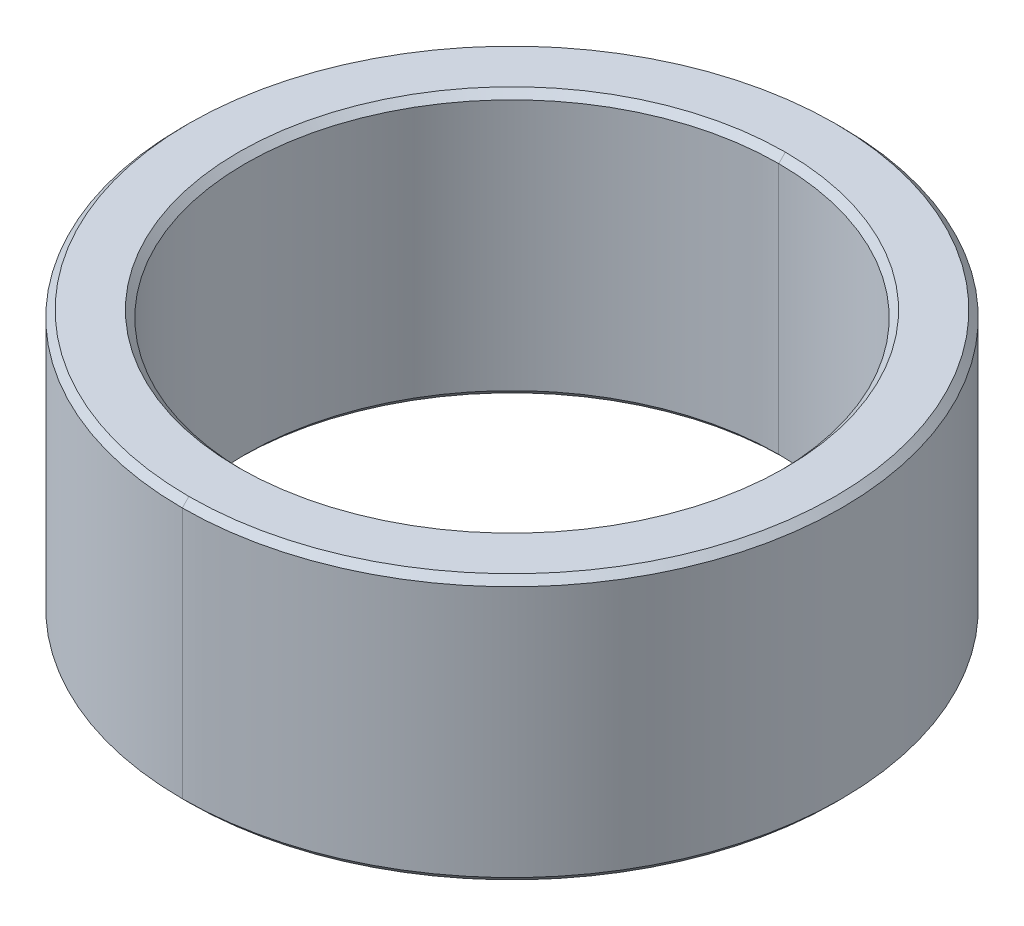
ISO-10303-21;
HEADER;
FILE_DESCRIPTION(('STEP AP214'),'2;1');
FILE_NAME('part.step','',(''),(''),'','','');
FILE_SCHEMA(('AUTOMOTIVE_DESIGN { 1 0 10303 214 1 1 1 1 }'));
ENDSEC;
DATA;
#1=APPLICATION_CONTEXT('core data for automotive mechanical design processes');
#2=APPLICATION_PROTOCOL_DEFINITION('international standard','automotive_design',2000,#1);
#3=PRODUCT_CONTEXT('',#1,'mechanical');
#4=PRODUCT('Part','Part','',(#3));
#5=PRODUCT_RELATED_PRODUCT_CATEGORY('part','',(#4));
#6=PRODUCT_DEFINITION_FORMATION('','',#4);
#7=PRODUCT_DEFINITION_CONTEXT('part definition',#1,'design');
#8=PRODUCT_DEFINITION('design','',#6,#7);
#9=PRODUCT_DEFINITION_SHAPE('','',#8);
#10=(LENGTH_UNIT() NAMED_UNIT(*) SI_UNIT(.MILLI.,.METRE.));
#11=(NAMED_UNIT(*) PLANE_ANGLE_UNIT() SI_UNIT($,.RADIAN.));
#12=(NAMED_UNIT(*) SI_UNIT($,.STERADIAN.) SOLID_ANGLE_UNIT());
#13=UNCERTAINTY_MEASURE_WITH_UNIT(LENGTH_MEASURE(1.E-05),#10,'distance_accuracy_value','');
#14=(GEOMETRIC_REPRESENTATION_CONTEXT(3) GLOBAL_UNCERTAINTY_ASSIGNED_CONTEXT((#13)) GLOBAL_UNIT_ASSIGNED_CONTEXT((#10,
#11,#12)) REPRESENTATION_CONTEXT('',''));
#15=CARTESIAN_POINT('',(0.,0.,0.));
#16=DIRECTION('',(0.,0.,1.));
#17=DIRECTION('',(1.,0.,0.));
#18=AXIS2_PLACEMENT_3D('',#15,#16,#17);
#19=CARTESIAN_POINT('',(0.,1.9,0.));
#20=DIRECTION('',(0.,1.,0.));
#21=DIRECTION('',(0.,0.,1.));
#22=AXIS2_PLACEMENT_3D('',#19,#20,#21);
#23=CONICAL_SURFACE('',#22,4.025,0.785398163397452);
#24=DIRECTION('',(0.,0.707106781186545,-0.707106781186551));
#25=VECTOR('',#24,1.);
#26=CARTESIAN_POINT('',(0.,1.9,-4.025));
#27=LINE('',#26,#25);
#28=CARTESIAN_POINT('',(0.,1.9,-4.025));
#29=VERTEX_POINT('',#28);
#30=CARTESIAN_POINT('',(0.,2.,-4.125));
#31=VERTEX_POINT('',#30);
#32=EDGE_CURVE('E188',#29,#31,#27,.T.);
#33=ORIENTED_EDGE('',*,*,#32,.F.);
#34=CARTESIAN_POINT('',(0.,1.9,0.));
#35=DIRECTION('',(0.,1.,0.));
#36=DIRECTION('',(0.,0.,1.));
#37=AXIS2_PLACEMENT_3D('',#34,#35,#36);
#38=CIRCLE('',#37,4.025);
#39=CARTESIAN_POINT('',(0.,1.9,4.025));
#40=VERTEX_POINT('',#39);
#41=EDGE_CURVE('E26',#40,#29,#38,.T.);
#42=ORIENTED_EDGE('',*,*,#41,.F.);
#43=DIRECTION('',(0.,0.707106781186545,0.707106781186551));
#44=VECTOR('',#43,1.);
#45=CARTESIAN_POINT('',(0.,1.9,4.025));
#46=LINE('',#45,#44);
#47=CARTESIAN_POINT('',(0.,2.,4.125));
#48=VERTEX_POINT('',#47);
#49=EDGE_CURVE('E133',#40,#48,#46,.T.);
#50=ORIENTED_EDGE('',*,*,#49,.T.);
#51=CARTESIAN_POINT('',(0.,2.,0.));
#52=DIRECTION('',(0.,-1.,0.));
#53=DIRECTION('',(0.,0.,1.));
#54=AXIS2_PLACEMENT_3D('',#51,#52,#53);
#55=CIRCLE('',#54,4.125);
#56=EDGE_CURVE('E99',#31,#48,#55,.T.);
#57=ORIENTED_EDGE('',*,*,#56,.F.);
#58=EDGE_LOOP('',(#33,#42,#50,#57));
#59=FACE_BOUND('',#58,.T.);
#60=ADVANCED_FACE('F15',(#59),#23,.F.);
#61=CARTESIAN_POINT('',(0.,-2.,0.));
#62=DIRECTION('',(0.,-1.,0.));
#63=DIRECTION('',(0.,0.,-1.));
#64=AXIS2_PLACEMENT_3D('',#61,#62,#63);
#65=CONICAL_SURFACE('',#64,4.125,0.785398163397452);
#66=DIRECTION('',(0.,-0.707106781186545,0.707106781186551));
#67=VECTOR('',#66,1.);
#68=CARTESIAN_POINT('',(0.,-2.,4.125));
#69=LINE('',#68,#67);
#70=CARTESIAN_POINT('',(0.,-1.9,4.025));
#71=VERTEX_POINT('',#70);
#72=CARTESIAN_POINT('',(0.,-2.,4.125));
#73=VERTEX_POINT('',#72);
#74=EDGE_CURVE('E128',#71,#73,#69,.T.);
#75=ORIENTED_EDGE('',*,*,#74,.F.);
#76=CARTESIAN_POINT('',(0.,-1.9,0.));
#77=DIRECTION('',(0.,-1.,0.));
#78=DIRECTION('',(0.,0.,1.));
#79=AXIS2_PLACEMENT_3D('',#76,#77,#78);
#80=CIRCLE('',#79,4.025);
#81=CARTESIAN_POINT('',(0.,-1.9,-4.025));
#82=VERTEX_POINT('',#81);
#83=EDGE_CURVE('E10',#82,#71,#80,.T.);
#84=ORIENTED_EDGE('',*,*,#83,.F.);
#85=DIRECTION('',(0.,-0.707106781186545,-0.707106781186551));
#86=VECTOR('',#85,1.);
#87=CARTESIAN_POINT('',(0.,-2.,-4.125));
#88=LINE('',#87,#86);
#89=CARTESIAN_POINT('',(0.,-2.,-4.125));
#90=VERTEX_POINT('',#89);
#91=EDGE_CURVE('E123',#82,#90,#88,.T.);
#92=ORIENTED_EDGE('',*,*,#91,.T.);
#93=CARTESIAN_POINT('',(0.,-2.,0.));
#94=DIRECTION('',(0.,1.,0.));
#95=DIRECTION('',(0.,0.,1.));
#96=AXIS2_PLACEMENT_3D('',#93,#94,#95);
#97=CIRCLE('',#96,4.125);
#98=EDGE_CURVE('E98',#73,#90,#97,.T.);
#99=ORIENTED_EDGE('',*,*,#98,.F.);
#100=EDGE_LOOP('',(#75,#84,#92,#99));
#101=FACE_BOUND('',#100,.T.);
#102=ADVANCED_FACE('F253',(#101),#65,.F.);
#103=CARTESIAN_POINT('',(0.,2.,0.));
#104=DIRECTION('',(0.,-1.,0.));
#105=DIRECTION('',(0.,0.,-1.));
#106=AXIS2_PLACEMENT_3D('',#103,#104,#105);
#107=CONICAL_SURFACE('',#106,4.875,0.785398163397452);
#108=DIRECTION('',(0.,-0.707106781186545,0.707106781186551));
#109=VECTOR('',#108,1.);
#110=CARTESIAN_POINT('',(0.,2.,4.875));
#111=LINE('',#110,#109);
#112=CARTESIAN_POINT('',(0.,2.,4.875));
#113=VERTEX_POINT('',#112);
#114=CARTESIAN_POINT('',(0.,1.9,4.975));
#115=VERTEX_POINT('',#114);
#116=EDGE_CURVE('E169',#113,#115,#111,.T.);
#117=ORIENTED_EDGE('',*,*,#116,.F.);
#118=CARTESIAN_POINT('',(0.,2.,0.));
#119=DIRECTION('',(0.,1.,0.));
#120=DIRECTION('',(0.,0.,1.));
#121=AXIS2_PLACEMENT_3D('',#118,#119,#120);
#122=CIRCLE('',#121,4.875);
#123=CARTESIAN_POINT('',(0.,2.,-4.875));
#124=VERTEX_POINT('',#123);
#125=EDGE_CURVE('E139',#124,#113,#122,.T.);
#126=ORIENTED_EDGE('',*,*,#125,.F.);
#127=DIRECTION('',(0.,-0.707106781186545,-0.707106781186551));
#128=VECTOR('',#127,1.);
#129=CARTESIAN_POINT('',(0.,2.,-4.875));
#130=LINE('',#129,#128);
#131=CARTESIAN_POINT('',(0.,1.9,-4.975));
#132=VERTEX_POINT('',#131);
#133=EDGE_CURVE('E109',#124,#132,#130,.T.);
#134=ORIENTED_EDGE('',*,*,#133,.T.);
#135=CARTESIAN_POINT('',(0.,1.9,0.));
#136=DIRECTION('',(0.,-1.,0.));
#137=DIRECTION('',(0.,0.,1.));
#138=AXIS2_PLACEMENT_3D('',#135,#136,#137);
#139=CIRCLE('',#138,4.975);
#140=EDGE_CURVE('E149',#115,#132,#139,.T.);
#141=ORIENTED_EDGE('',*,*,#140,.F.);
#142=EDGE_LOOP('',(#117,#126,#134,#141));
#143=FACE_BOUND('',#142,.T.);
#144=ADVANCED_FACE('F234',(#143),#107,.T.);
#145=CARTESIAN_POINT('',(0.,-1.9,0.));
#146=DIRECTION('',(0.,1.,0.));
#147=DIRECTION('',(0.,0.,1.));
#148=AXIS2_PLACEMENT_3D('',#145,#146,#147);
#149=CONICAL_SURFACE('',#148,4.975,0.785398163397443);
#150=DIRECTION('',(0.,0.707106781186551,-0.707106781186545));
#151=VECTOR('',#150,1.);
#152=CARTESIAN_POINT('',(0.,-1.9,-4.975));
#153=LINE('',#152,#151);
#154=CARTESIAN_POINT('',(0.,-2.,-4.875));
#155=VERTEX_POINT('',#154);
#156=CARTESIAN_POINT('',(0.,-1.9,-4.975));
#157=VERTEX_POINT('',#156);
#158=EDGE_CURVE('E93',#155,#157,#153,.T.);
#159=ORIENTED_EDGE('',*,*,#158,.F.);
#160=CARTESIAN_POINT('',(0.,-2.,0.));
#161=DIRECTION('',(0.,-1.,0.));
#162=DIRECTION('',(0.,0.,1.));
#163=AXIS2_PLACEMENT_3D('',#160,#161,#162);
#164=CIRCLE('',#163,4.875);
#165=CARTESIAN_POINT('',(0.,-2.,4.875));
#166=VERTEX_POINT('',#165);
#167=EDGE_CURVE('E88',#166,#155,#164,.T.);
#168=ORIENTED_EDGE('',*,*,#167,.F.);
#169=DIRECTION('',(0.,0.707106781186551,0.707106781186545));
#170=VECTOR('',#169,1.);
#171=CARTESIAN_POINT('',(0.,-1.9,4.975));
#172=LINE('',#171,#170);
#173=CARTESIAN_POINT('',(0.,-1.9,4.975));
#174=VERTEX_POINT('',#173);
#175=EDGE_CURVE('E19',#166,#174,#172,.T.);
#176=ORIENTED_EDGE('',*,*,#175,.T.);
#177=CARTESIAN_POINT('',(0.,-1.9,0.));
#178=DIRECTION('',(0.,1.,0.));
#179=DIRECTION('',(0.,0.,1.));
#180=AXIS2_PLACEMENT_3D('',#177,#178,#179);
#181=CIRCLE('',#180,4.975);
#182=EDGE_CURVE('E41',#157,#174,#181,.T.);
#183=ORIENTED_EDGE('',*,*,#182,.F.);
#184=EDGE_LOOP('',(#159,#168,#176,#183));
#185=FACE_BOUND('',#184,.T.);
#186=ADVANCED_FACE('F90',(#185),#149,.T.);
#187=CARTESIAN_POINT('',(0.,2.,0.));
#188=DIRECTION('',(0.,-1.,0.));
#189=DIRECTION('',(0.,0.,-1.));
#190=AXIS2_PLACEMENT_3D('',#187,#188,#189);
#191=CYLINDRICAL_SURFACE('',#190,4.025);
#192=DIRECTION('',(0.,-1.,0.));
#193=VECTOR('',#192,1.);
#194=CARTESIAN_POINT('',(0.,2.,4.025));
#195=LINE('',#194,#193);
#196=EDGE_CURVE('E107',#40,#71,#195,.T.);
#197=ORIENTED_EDGE('',*,*,#196,.F.);
#198=ORIENTED_EDGE('',*,*,#41,.T.);
#199=DIRECTION('',(0.,-1.,0.));
#200=VECTOR('',#199,1.);
#201=CARTESIAN_POINT('',(0.,2.,-4.025));
#202=LINE('',#201,#200);
#203=EDGE_CURVE('E174',#29,#82,#202,.T.);
#204=ORIENTED_EDGE('',*,*,#203,.T.);
#205=ORIENTED_EDGE('',*,*,#83,.T.);
#206=EDGE_LOOP('',(#197,#198,#204,#205));
#207=FACE_BOUND('',#206,.T.);
#208=ADVANCED_FACE('F242',(#207),#191,.F.);
#209=CARTESIAN_POINT('',(0.,2.,0.));
#210=DIRECTION('',(0.,-1.,0.));
#211=DIRECTION('',(0.,0.,-1.));
#212=AXIS2_PLACEMENT_3D('',#209,#210,#211);
#213=CYLINDRICAL_SURFACE('',#212,4.975);
#214=DIRECTION('',(0.,-1.,0.));
#215=VECTOR('',#214,1.);
#216=CARTESIAN_POINT('',(0.,2.,4.975));
#217=LINE('',#216,#215);
#218=EDGE_CURVE('E140',#115,#174,#217,.T.);
#219=ORIENTED_EDGE('',*,*,#218,.F.);
#220=ORIENTED_EDGE('',*,*,#140,.T.);
#221=DIRECTION('',(0.,-1.,0.));
#222=VECTOR('',#221,1.);
#223=CARTESIAN_POINT('',(0.,2.,-4.975));
#224=LINE('',#223,#222);
#225=EDGE_CURVE('E137',#132,#157,#224,.T.);
#226=ORIENTED_EDGE('',*,*,#225,.T.);
#227=ORIENTED_EDGE('',*,*,#182,.T.);
#228=EDGE_LOOP('',(#219,#220,#226,#227));
#229=FACE_BOUND('',#228,.T.);
#230=ADVANCED_FACE('F240',(#229),#213,.T.);
#231=CARTESIAN_POINT('',(0.,-2.,0.));
#232=DIRECTION('',(0.,1.,0.));
#233=DIRECTION('',(1.,0.,0.));
#234=AXIS2_PLACEMENT_3D('',#231,#232,#233);
#235=PLANE('',#234);
#236=CARTESIAN_POINT('',(0.,-2.,0.));
#237=DIRECTION('',(0.,1.,0.));
#238=DIRECTION('',(0.,0.,1.));
#239=AXIS2_PLACEMENT_3D('',#236,#237,#238);
#240=CIRCLE('',#239,4.125);
#241=EDGE_CURVE('E125',#90,#73,#240,.T.);
#242=ORIENTED_EDGE('',*,*,#241,.T.);
#243=ORIENTED_EDGE('',*,*,#98,.T.);
#244=EDGE_LOOP('',(#242,#243));
#245=FACE_BOUND('',#244,.T.);
#246=ORIENTED_EDGE('',*,*,#167,.T.);
#247=CARTESIAN_POINT('',(0.,-2.,0.));
#248=DIRECTION('',(0.,-1.,0.));
#249=DIRECTION('',(0.,0.,1.));
#250=AXIS2_PLACEMENT_3D('',#247,#248,#249);
#251=CIRCLE('',#250,4.875);
#252=EDGE_CURVE('E103',#155,#166,#251,.T.);
#253=ORIENTED_EDGE('',*,*,#252,.T.);
#254=EDGE_LOOP('',(#246,#253));
#255=FACE_BOUND('',#254,.T.);
#256=ADVANCED_FACE('F17',(#245,#255),#235,.F.);
#257=CARTESIAN_POINT('',(0.,2.,0.));
#258=DIRECTION('',(0.,1.,0.));
#259=DIRECTION('',(1.,0.,0.));
#260=AXIS2_PLACEMENT_3D('',#257,#258,#259);
#261=PLANE('',#260);
#262=CARTESIAN_POINT('',(0.,2.,0.));
#263=DIRECTION('',(0.,-1.,0.));
#264=DIRECTION('',(0.,0.,1.));
#265=AXIS2_PLACEMENT_3D('',#262,#263,#264);
#266=CIRCLE('',#265,4.125);
#267=EDGE_CURVE('E145',#48,#31,#266,.T.);
#268=ORIENTED_EDGE('',*,*,#267,.T.);
#269=ORIENTED_EDGE('',*,*,#56,.T.);
#270=EDGE_LOOP('',(#268,#269));
#271=FACE_BOUND('',#270,.T.);
#272=ORIENTED_EDGE('',*,*,#125,.T.);
#273=CARTESIAN_POINT('',(0.,2.,0.));
#274=DIRECTION('',(0.,1.,0.));
#275=DIRECTION('',(0.,0.,1.));
#276=AXIS2_PLACEMENT_3D('',#273,#274,#275);
#277=CIRCLE('',#276,4.875);
#278=EDGE_CURVE('E166',#113,#124,#277,.T.);
#279=ORIENTED_EDGE('',*,*,#278,.T.);
#280=EDGE_LOOP('',(#272,#279));
#281=FACE_BOUND('',#280,.T.);
#282=ADVANCED_FACE('F230',(#271,#281),#261,.T.);
#283=CARTESIAN_POINT('',(0.,2.,0.));
#284=DIRECTION('',(0.,-1.,0.));
#285=DIRECTION('',(0.,0.,-1.));
#286=AXIS2_PLACEMENT_3D('',#283,#284,#285);
#287=CYLINDRICAL_SURFACE('',#286,4.975);
#288=CARTESIAN_POINT('',(0.,1.9,0.));
#289=DIRECTION('',(0.,-1.,0.));
#290=DIRECTION('',(0.,0.,1.));
#291=AXIS2_PLACEMENT_3D('',#288,#289,#290);
#292=CIRCLE('',#291,4.975);
#293=EDGE_CURVE('E119',#132,#115,#292,.T.);
#294=ORIENTED_EDGE('',*,*,#293,.T.);
#295=ORIENTED_EDGE('',*,*,#218,.T.);
#296=CARTESIAN_POINT('',(0.,-1.9,0.));
#297=DIRECTION('',(0.,1.,0.));
#298=DIRECTION('',(0.,0.,1.));
#299=AXIS2_PLACEMENT_3D('',#296,#297,#298);
#300=CIRCLE('',#299,4.975);
#301=EDGE_CURVE('E105',#174,#157,#300,.T.);
#302=ORIENTED_EDGE('',*,*,#301,.T.);
#303=ORIENTED_EDGE('',*,*,#225,.F.);
#304=EDGE_LOOP('',(#294,#295,#302,#303));
#305=FACE_BOUND('',#304,.T.);
#306=ADVANCED_FACE('F239',(#305),#287,.T.);
#307=CARTESIAN_POINT('',(0.,2.,0.));
#308=DIRECTION('',(0.,-1.,0.));
#309=DIRECTION('',(0.,0.,-1.));
#310=AXIS2_PLACEMENT_3D('',#307,#308,#309);
#311=CYLINDRICAL_SURFACE('',#310,4.025);
#312=CARTESIAN_POINT('',(0.,1.9,0.));
#313=DIRECTION('',(0.,1.,0.));
#314=DIRECTION('',(0.,0.,1.));
#315=AXIS2_PLACEMENT_3D('',#312,#313,#314);
#316=CIRCLE('',#315,4.025);
#317=EDGE_CURVE('E190',#29,#40,#316,.T.);
#318=ORIENTED_EDGE('',*,*,#317,.T.);
#319=ORIENTED_EDGE('',*,*,#196,.T.);
#320=CARTESIAN_POINT('',(0.,-1.9,0.));
#321=DIRECTION('',(0.,-1.,0.));
#322=DIRECTION('',(0.,0.,1.));
#323=AXIS2_PLACEMENT_3D('',#320,#321,#322);
#324=CIRCLE('',#323,4.025);
#325=EDGE_CURVE('E129',#71,#82,#324,.T.);
#326=ORIENTED_EDGE('',*,*,#325,.T.);
#327=ORIENTED_EDGE('',*,*,#203,.F.);
#328=EDGE_LOOP('',(#318,#319,#326,#327));
#329=FACE_BOUND('',#328,.T.);
#330=ADVANCED_FACE('F274',(#329),#311,.F.);
#331=CARTESIAN_POINT('',(0.,-1.9,0.));
#332=DIRECTION('',(0.,1.,0.));
#333=DIRECTION('',(0.,0.,1.));
#334=AXIS2_PLACEMENT_3D('',#331,#332,#333);
#335=CONICAL_SURFACE('',#334,4.975,0.785398163397443);
#336=ORIENTED_EDGE('',*,*,#252,.F.);
#337=ORIENTED_EDGE('',*,*,#158,.T.);
#338=ORIENTED_EDGE('',*,*,#301,.F.);
#339=ORIENTED_EDGE('',*,*,#175,.F.);
#340=EDGE_LOOP('',(#336,#337,#338,#339));
#341=FACE_BOUND('',#340,.T.);
#342=ADVANCED_FACE('F102',(#341),#335,.T.);
#343=CARTESIAN_POINT('',(0.,2.,0.));
#344=DIRECTION('',(0.,-1.,0.));
#345=DIRECTION('',(0.,0.,-1.));
#346=AXIS2_PLACEMENT_3D('',#343,#344,#345);
#347=CONICAL_SURFACE('',#346,4.875,0.785398163397452);
#348=ORIENTED_EDGE('',*,*,#278,.F.);
#349=ORIENTED_EDGE('',*,*,#116,.T.);
#350=ORIENTED_EDGE('',*,*,#293,.F.);
#351=ORIENTED_EDGE('',*,*,#133,.F.);
#352=EDGE_LOOP('',(#348,#349,#350,#351));
#353=FACE_BOUND('',#352,.T.);
#354=ADVANCED_FACE('F237',(#353),#347,.T.);
#355=CARTESIAN_POINT('',(0.,-2.,0.));
#356=DIRECTION('',(0.,-1.,0.));
#357=DIRECTION('',(0.,0.,-1.));
#358=AXIS2_PLACEMENT_3D('',#355,#356,#357);
#359=CONICAL_SURFACE('',#358,4.125,0.785398163397452);
#360=ORIENTED_EDGE('',*,*,#325,.F.);
#361=ORIENTED_EDGE('',*,*,#74,.T.);
#362=ORIENTED_EDGE('',*,*,#241,.F.);
#363=ORIENTED_EDGE('',*,*,#91,.F.);
#364=EDGE_LOOP('',(#360,#361,#362,#363));
#365=FACE_BOUND('',#364,.T.);
#366=ADVANCED_FACE('F262',(#365),#359,.F.);
#367=CARTESIAN_POINT('',(0.,1.9,0.));
#368=DIRECTION('',(0.,1.,0.));
#369=DIRECTION('',(0.,0.,1.));
#370=AXIS2_PLACEMENT_3D('',#367,#368,#369);
#371=CONICAL_SURFACE('',#370,4.025,0.785398163397452);
#372=ORIENTED_EDGE('',*,*,#317,.F.);
#373=ORIENTED_EDGE('',*,*,#32,.T.);
#374=ORIENTED_EDGE('',*,*,#267,.F.);
#375=ORIENTED_EDGE('',*,*,#49,.F.);
#376=EDGE_LOOP('',(#372,#373,#374,#375));
#377=FACE_BOUND('',#376,.T.);
#378=ADVANCED_FACE('F204',(#377),#371,.F.);
#379=CLOSED_SHELL('',(#60,#102,#144,#186,#208,#230,#256,#282,#306,#330,#342,#354,#366,#378));
#380=MANIFOLD_SOLID_BREP('B1',#379);
#381=ADVANCED_BREP_SHAPE_REPRESENTATION('',(#18,#380),#14);
#382=SHAPE_DEFINITION_REPRESENTATION(#9,#381);
ENDSEC;
END-ISO-10303-21;
